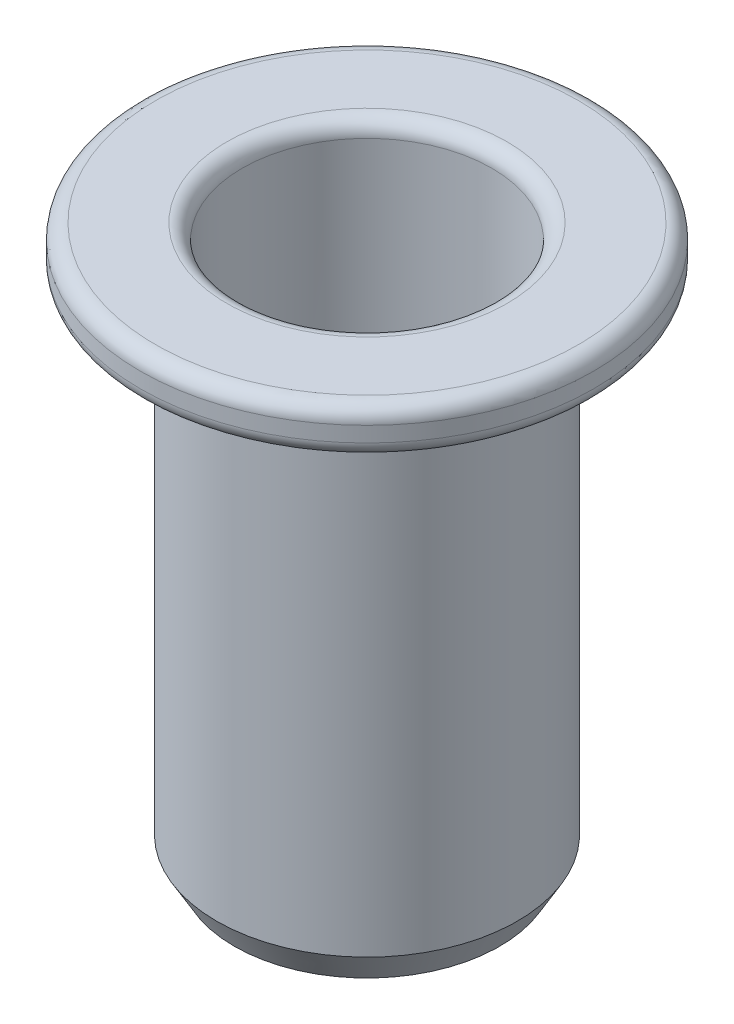
ISO-10303-21;
HEADER;
FILE_DESCRIPTION(('STEP AP214'),'2;1');
FILE_NAME('part.step','',(''),(''),'','','');
FILE_SCHEMA(('AUTOMOTIVE_DESIGN { 1 0 10303 214 1 1 1 1 }'));
ENDSEC;
DATA;
#1=APPLICATION_CONTEXT('core data for automotive mechanical design processes');
#2=APPLICATION_PROTOCOL_DEFINITION('international standard','automotive_design',2000,#1);
#3=PRODUCT_CONTEXT('',#1,'mechanical');
#4=PRODUCT('Part','Part','',(#3));
#5=PRODUCT_RELATED_PRODUCT_CATEGORY('part','',(#4));
#6=PRODUCT_DEFINITION_FORMATION('','',#4);
#7=PRODUCT_DEFINITION_CONTEXT('part definition',#1,'design');
#8=PRODUCT_DEFINITION('design','',#6,#7);
#9=PRODUCT_DEFINITION_SHAPE('','',#8);
#10=(LENGTH_UNIT() NAMED_UNIT(*) SI_UNIT(.MILLI.,.METRE.));
#11=(NAMED_UNIT(*) PLANE_ANGLE_UNIT() SI_UNIT($,.RADIAN.));
#12=(NAMED_UNIT(*) SI_UNIT($,.STERADIAN.) SOLID_ANGLE_UNIT());
#13=UNCERTAINTY_MEASURE_WITH_UNIT(LENGTH_MEASURE(1.E-05),#10,'distance_accuracy_value','');
#14=(GEOMETRIC_REPRESENTATION_CONTEXT(3) GLOBAL_UNCERTAINTY_ASSIGNED_CONTEXT((#13)) GLOBAL_UNIT_ASSIGNED_CONTEXT((#10,
#11,#12)) REPRESENTATION_CONTEXT('',''));
#15=CARTESIAN_POINT('',(0.,0.,0.));
#16=DIRECTION('',(0.,0.,1.));
#17=DIRECTION('',(1.,0.,0.));
#18=AXIS2_PLACEMENT_3D('',#15,#16,#17);
#19=CARTESIAN_POINT('',(0.,0.,0.));
#20=DIRECTION('',(0.,1.,0.));
#21=DIRECTION('',(0.,0.,1.));
#22=AXIS2_PLACEMENT_3D('',#19,#20,#21);
#23=CYLINDRICAL_SURFACE('',#22,2.45);
#24=CARTESIAN_POINT('',(0.,-0.3,0.));
#25=DIRECTION('',(0.,-1.,0.));
#26=DIRECTION('',(0.,0.,-1.));
#27=AXIS2_PLACEMENT_3D('',#24,#25,#26);
#28=CIRCLE('',#27,2.45);
#29=CARTESIAN_POINT('',(0.,-0.3,-2.45));
#30=VERTEX_POINT('',#29);
#31=EDGE_CURVE('E51',#30,#30,#28,.F.);
#32=ORIENTED_EDGE('',*,*,#31,.T.);
#33=EDGE_LOOP('',(#32));
#34=FACE_BOUND('',#33,.T.);
#35=CARTESIAN_POINT('',(0.,-4.9,0.));
#36=DIRECTION('',(0.,1.,0.));
#37=DIRECTION('',(0.,0.,1.));
#38=AXIS2_PLACEMENT_3D('',#35,#36,#37);
#39=CIRCLE('',#38,2.45);
#40=CARTESIAN_POINT('',(0.,-4.9,2.45));
#41=VERTEX_POINT('',#40);
#42=EDGE_CURVE('E75',#41,#41,#39,.T.);
#43=ORIENTED_EDGE('',*,*,#42,.F.);
#44=EDGE_LOOP('',(#43));
#45=FACE_BOUND('',#44,.T.);
#46=ADVANCED_FACE('F31',(#34,#45),#23,.F.);
#47=CARTESIAN_POINT('',(2.45,0.,0.));
#48=DIRECTION('',(0.,-1.,0.));
#49=DIRECTION('',(0.,0.,-1.));
#50=AXIS2_PLACEMENT_3D('',#47,#48,#49);
#51=PLANE('',#50);
#52=CARTESIAN_POINT('',(0.,0.,0.));
#53=DIRECTION('',(0.,-1.,0.));
#54=DIRECTION('',(0.,0.,-1.));
#55=AXIS2_PLACEMENT_3D('',#52,#53,#54);
#56=CIRCLE('',#55,4.15);
#57=CARTESIAN_POINT('',(0.,0.,-4.15));
#58=VERTEX_POINT('',#57);
#59=EDGE_CURVE('E54',#58,#58,#56,.F.);
#60=ORIENTED_EDGE('',*,*,#59,.T.);
#61=EDGE_LOOP('',(#60));
#62=FACE_BOUND('',#61,.T.);
#63=CARTESIAN_POINT('',(0.,0.,0.));
#64=DIRECTION('',(0.,-1.,0.));
#65=DIRECTION('',(0.,0.,-1.));
#66=AXIS2_PLACEMENT_3D('',#63,#64,#65);
#67=CIRCLE('',#66,2.75);
#68=CARTESIAN_POINT('',(0.,0.,-2.75));
#69=VERTEX_POINT('',#68);
#70=EDGE_CURVE('E57',#69,#69,#67,.T.);
#71=ORIENTED_EDGE('',*,*,#70,.T.);
#72=EDGE_LOOP('',(#71));
#73=FACE_BOUND('',#72,.T.);
#74=ADVANCED_FACE('F82',(#62,#73),#51,.F.);
#75=CARTESIAN_POINT('',(0.,0.,0.));
#76=DIRECTION('',(0.,1.,0.));
#77=DIRECTION('',(0.,0.,1.));
#78=AXIS2_PLACEMENT_3D('',#75,#76,#77);
#79=CYLINDRICAL_SURFACE('',#78,4.45);
#80=CARTESIAN_POINT('',(0.,-0.6,0.));
#81=DIRECTION('',(0.,1.,0.));
#82=DIRECTION('',(0.,0.,1.));
#83=AXIS2_PLACEMENT_3D('',#80,#81,#82);
#84=CIRCLE('',#83,4.45);
#85=CARTESIAN_POINT('',(0.,-0.6,4.45));
#86=VERTEX_POINT('',#85);
#87=EDGE_CURVE('E63',#86,#86,#84,.T.);
#88=ORIENTED_EDGE('',*,*,#87,.T.);
#89=EDGE_LOOP('',(#88));
#90=FACE_BOUND('',#89,.T.);
#91=CARTESIAN_POINT('',(0.,-0.3,0.));
#92=DIRECTION('',(0.,-1.,0.));
#93=DIRECTION('',(0.,0.,-1.));
#94=AXIS2_PLACEMENT_3D('',#91,#92,#93);
#95=CIRCLE('',#94,4.45);
#96=CARTESIAN_POINT('',(0.,-0.3,-4.45));
#97=VERTEX_POINT('',#96);
#98=EDGE_CURVE('E66',#97,#97,#95,.T.);
#99=ORIENTED_EDGE('',*,*,#98,.T.);
#100=EDGE_LOOP('',(#99));
#101=FACE_BOUND('',#100,.T.);
#102=ADVANCED_FACE('F88',(#90,#101),#79,.T.);
#103=CARTESIAN_POINT('',(4.45,-0.9,0.));
#104=DIRECTION('',(0.,1.,0.));
#105=DIRECTION('',(0.,0.,1.));
#106=AXIS2_PLACEMENT_3D('',#103,#104,#105);
#107=PLANE('',#106);
#108=CARTESIAN_POINT('',(0.,-0.9,0.));
#109=DIRECTION('',(0.,1.,0.));
#110=DIRECTION('',(0.,0.,1.));
#111=AXIS2_PLACEMENT_3D('',#108,#109,#110);
#112=CIRCLE('',#111,4.15);
#113=CARTESIAN_POINT('',(0.,-0.9,4.15));
#114=VERTEX_POINT('',#113);
#115=EDGE_CURVE('E60',#114,#114,#112,.F.);
#116=ORIENTED_EDGE('',*,*,#115,.T.);
#117=EDGE_LOOP('',(#116));
#118=FACE_BOUND('',#117,.T.);
#119=CARTESIAN_POINT('',(0.,-0.9,0.));
#120=DIRECTION('',(0.,1.,0.));
#121=DIRECTION('',(0.,0.,1.));
#122=AXIS2_PLACEMENT_3D('',#119,#120,#121);
#123=CIRCLE('',#122,2.95);
#124=CARTESIAN_POINT('',(0.,-0.9,2.95));
#125=VERTEX_POINT('',#124);
#126=EDGE_CURVE('E69',#125,#125,#123,.T.);
#127=ORIENTED_EDGE('',*,*,#126,.T.);
#128=EDGE_LOOP('',(#127));
#129=FACE_BOUND('',#128,.T.);
#130=ADVANCED_FACE('F119',(#118,#129),#107,.F.);
#131=CARTESIAN_POINT('',(0.,0.,0.));
#132=DIRECTION('',(0.,1.,0.));
#133=DIRECTION('',(0.,0.,1.));
#134=AXIS2_PLACEMENT_3D('',#131,#132,#133);
#135=CYLINDRICAL_SURFACE('',#134,2.95);
#136=CARTESIAN_POINT('',(0.,-10.4,0.));
#137=DIRECTION('',(0.,1.,0.));
#138=DIRECTION('',(0.,0.,1.));
#139=AXIS2_PLACEMENT_3D('',#136,#137,#138);
#140=CIRCLE('',#139,2.95);
#141=CARTESIAN_POINT('',(0.,-10.4,2.95));
#142=VERTEX_POINT('',#141);
#143=EDGE_CURVE('E46',#142,#142,#140,.T.);
#144=ORIENTED_EDGE('',*,*,#143,.T.);
#145=EDGE_LOOP('',(#144));
#146=FACE_BOUND('',#145,.T.);
#147=ORIENTED_EDGE('',*,*,#126,.F.);
#148=EDGE_LOOP('',(#147));
#149=FACE_BOUND('',#148,.T.);
#150=ADVANCED_FACE('F115',(#146,#149),#135,.T.);
#151=CARTESIAN_POINT('',(2.95,-11.,0.));
#152=DIRECTION('',(0.,1.,0.));
#153=DIRECTION('',(0.,0.,1.));
#154=AXIS2_PLACEMENT_3D('',#151,#152,#153);
#155=PLANE('',#154);
#156=CARTESIAN_POINT('',(0.,-11.,0.));
#157=DIRECTION('',(0.,1.,0.));
#158=DIRECTION('',(0.,0.,1.));
#159=AXIS2_PLACEMENT_3D('',#156,#157,#158);
#160=CIRCLE('',#159,2.28867513459481);
#161=CARTESIAN_POINT('',(0.,-11.,2.28867513459481));
#162=VERTEX_POINT('',#161);
#163=EDGE_CURVE('E38',#162,#162,#160,.T.);
#164=ORIENTED_EDGE('',*,*,#163,.T.);
#165=EDGE_LOOP('',(#164));
#166=FACE_BOUND('',#165,.T.);
#167=CARTESIAN_POINT('',(0.,-11.,0.));
#168=DIRECTION('',(0.,1.,0.));
#169=DIRECTION('',(0.,0.,1.));
#170=AXIS2_PLACEMENT_3D('',#167,#168,#169);
#171=CIRCLE('',#170,2.60358983848623);
#172=CARTESIAN_POINT('',(0.,-11.,2.60358983848623));
#173=VERTEX_POINT('',#172);
#174=EDGE_CURVE('E42',#173,#173,#171,.F.);
#175=ORIENTED_EDGE('',*,*,#174,.T.);
#176=EDGE_LOOP('',(#175));
#177=FACE_BOUND('',#176,.T.);
#178=ADVANCED_FACE('F118',(#166,#177),#155,.F.);
#179=CARTESIAN_POINT('',(0.,0.,0.));
#180=DIRECTION('',(0.,1.,0.));
#181=DIRECTION('',(0.,0.,1.));
#182=AXIS2_PLACEMENT_3D('',#179,#180,#181);
#183=CYLINDRICAL_SURFACE('',#182,2.);
#184=CARTESIAN_POINT('',(0.,-10.5,0.));
#185=DIRECTION('',(0.,1.,0.));
#186=DIRECTION('',(0.,0.,1.));
#187=AXIS2_PLACEMENT_3D('',#184,#185,#186);
#188=CIRCLE('',#187,2.);
#189=CARTESIAN_POINT('',(0.,-10.5,2.));
#190=VERTEX_POINT('',#189);
#191=EDGE_CURVE('E10',#190,#190,#188,.F.);
#192=ORIENTED_EDGE('',*,*,#191,.T.);
#193=EDGE_LOOP('',(#192));
#194=FACE_BOUND('',#193,.T.);
#195=CARTESIAN_POINT('',(0.,-4.9,0.));
#196=DIRECTION('',(0.,1.,0.));
#197=DIRECTION('',(0.,0.,1.));
#198=AXIS2_PLACEMENT_3D('',#195,#196,#197);
#199=CIRCLE('',#198,2.);
#200=CARTESIAN_POINT('',(0.,-4.9,2.));
#201=VERTEX_POINT('',#200);
#202=EDGE_CURVE('E72',#201,#201,#199,.T.);
#203=ORIENTED_EDGE('',*,*,#202,.T.);
#204=EDGE_LOOP('',(#203));
#205=FACE_BOUND('',#204,.T.);
#206=ADVANCED_FACE('F133',(#194,#205),#183,.F.);
#207=CARTESIAN_POINT('',(2.,-4.9,0.));
#208=DIRECTION('',(0.,-1.,0.));
#209=DIRECTION('',(0.,0.,-1.));
#210=AXIS2_PLACEMENT_3D('',#207,#208,#209);
#211=PLANE('',#210);
#212=ORIENTED_EDGE('',*,*,#202,.F.);
#213=EDGE_LOOP('',(#212));
#214=FACE_BOUND('',#213,.T.);
#215=ORIENTED_EDGE('',*,*,#42,.T.);
#216=EDGE_LOOP('',(#215));
#217=FACE_BOUND('',#216,.T.);
#218=ADVANCED_FACE('F79',(#214,#217),#211,.F.);
#219=CARTESIAN_POINT('',(0.,-0.6,0.));
#220=DIRECTION('',(0.,1.,0.));
#221=DIRECTION('',(0.,0.,1.));
#222=AXIS2_PLACEMENT_3D('',#219,#220,#221);
#223=TOROIDAL_SURFACE('',#222,4.15,0.3);
#224=ORIENTED_EDGE('',*,*,#115,.F.);
#225=EDGE_LOOP('',(#224));
#226=FACE_BOUND('',#225,.T.);
#227=ORIENTED_EDGE('',*,*,#87,.F.);
#228=EDGE_LOOP('',(#227));
#229=FACE_BOUND('',#228,.T.);
#230=ADVANCED_FACE('F93',(#226,#229),#223,.T.);
#231=CARTESIAN_POINT('',(0.,-0.3,0.));
#232=DIRECTION('',(0.,-1.,0.));
#233=DIRECTION('',(0.,0.,-1.));
#234=AXIS2_PLACEMENT_3D('',#231,#232,#233);
#235=TOROIDAL_SURFACE('',#234,4.15,0.3);
#236=ORIENTED_EDGE('',*,*,#98,.F.);
#237=EDGE_LOOP('',(#236));
#238=FACE_BOUND('',#237,.T.);
#239=ORIENTED_EDGE('',*,*,#59,.F.);
#240=EDGE_LOOP('',(#239));
#241=FACE_BOUND('',#240,.T.);
#242=ADVANCED_FACE('F96',(#238,#241),#235,.T.);
#243=CARTESIAN_POINT('',(0.,-0.3,0.));
#244=DIRECTION('',(0.,-1.,0.));
#245=DIRECTION('',(0.,0.,-1.));
#246=AXIS2_PLACEMENT_3D('',#243,#244,#245);
#247=TOROIDAL_SURFACE('',#246,2.75,0.3);
#248=ORIENTED_EDGE('',*,*,#70,.F.);
#249=EDGE_LOOP('',(#248));
#250=FACE_BOUND('',#249,.T.);
#251=ORIENTED_EDGE('',*,*,#31,.F.);
#252=EDGE_LOOP('',(#251));
#253=FACE_BOUND('',#252,.T.);
#254=ADVANCED_FACE('F100',(#250,#253),#247,.T.);
#255=CARTESIAN_POINT('',(0.,-10.4,0.));
#256=DIRECTION('',(0.,1.,0.));
#257=DIRECTION('',(0.,0.,1.));
#258=AXIS2_PLACEMENT_3D('',#255,#256,#257);
#259=CONICAL_SURFACE('',#258,2.95,0.523598775598296);
#260=ORIENTED_EDGE('',*,*,#174,.F.);
#261=EDGE_LOOP('',(#260));
#262=FACE_BOUND('',#261,.T.);
#263=ORIENTED_EDGE('',*,*,#143,.F.);
#264=EDGE_LOOP('',(#263));
#265=FACE_BOUND('',#264,.T.);
#266=ADVANCED_FACE('F103',(#262,#265),#259,.T.);
#267=CARTESIAN_POINT('',(0.,-11.,0.));
#268=DIRECTION('',(0.,-1.,0.));
#269=DIRECTION('',(0.,0.,-1.));
#270=AXIS2_PLACEMENT_3D('',#267,#268,#269);
#271=CONICAL_SURFACE('',#270,2.28867513459481,0.523598775598295);
#272=ORIENTED_EDGE('',*,*,#191,.F.);
#273=EDGE_LOOP('',(#272));
#274=FACE_BOUND('',#273,.T.);
#275=ORIENTED_EDGE('',*,*,#163,.F.);
#276=EDGE_LOOP('',(#275));
#277=FACE_BOUND('',#276,.T.);
#278=ADVANCED_FACE('F33',(#274,#277),#271,.F.);
#279=CLOSED_SHELL('',(#46,#74,#102,#130,#150,#178,#206,#218,#230,#242,#254,#266,#278));
#280=MANIFOLD_SOLID_BREP('B2',#279);
#281=ADVANCED_BREP_SHAPE_REPRESENTATION('',(#18,#280),#14);
#282=SHAPE_DEFINITION_REPRESENTATION(#9,#281);
ENDSEC;
END-ISO-10303-21;
